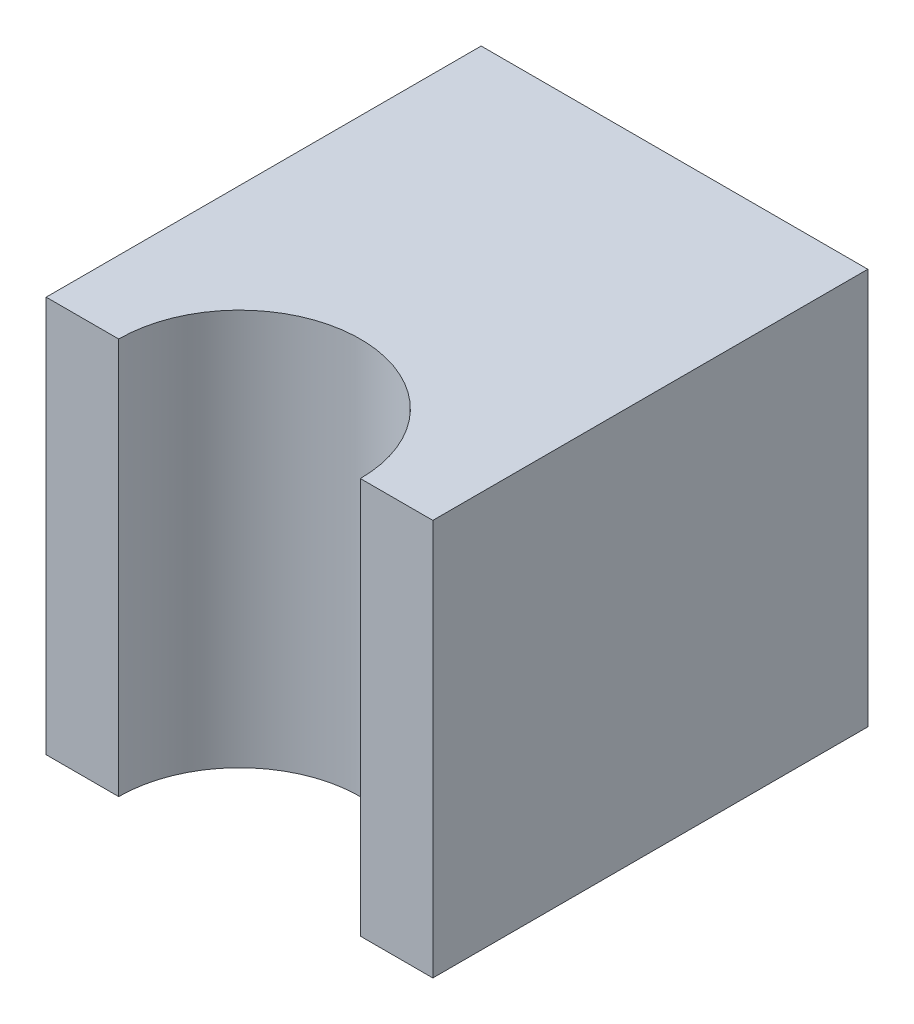
ISO-10303-21;
HEADER;
FILE_DESCRIPTION(('STEP AP214'),'2;1');
FILE_NAME('part.step','',(''),(''),'','','');
FILE_SCHEMA(('AUTOMOTIVE_DESIGN { 1 0 10303 214 1 1 1 1 }'));
ENDSEC;
DATA;
#1=APPLICATION_CONTEXT('core data for automotive mechanical design processes');
#2=APPLICATION_PROTOCOL_DEFINITION('international standard','automotive_design',2000,#1);
#3=PRODUCT_CONTEXT('',#1,'mechanical');
#4=PRODUCT('Part','Part','',(#3));
#5=PRODUCT_RELATED_PRODUCT_CATEGORY('part','',(#4));
#6=PRODUCT_DEFINITION_FORMATION('','',#4);
#7=PRODUCT_DEFINITION_CONTEXT('part definition',#1,'design');
#8=PRODUCT_DEFINITION('design','',#6,#7);
#9=PRODUCT_DEFINITION_SHAPE('','',#8);
#10=(LENGTH_UNIT() NAMED_UNIT(*) SI_UNIT(.MILLI.,.METRE.));
#11=(NAMED_UNIT(*) PLANE_ANGLE_UNIT() SI_UNIT($,.RADIAN.));
#12=(NAMED_UNIT(*) SI_UNIT($,.STERADIAN.) SOLID_ANGLE_UNIT());
#13=UNCERTAINTY_MEASURE_WITH_UNIT(LENGTH_MEASURE(1.E-05),#10,'distance_accuracy_value','');
#14=(GEOMETRIC_REPRESENTATION_CONTEXT(3) GLOBAL_UNCERTAINTY_ASSIGNED_CONTEXT((#13)) GLOBAL_UNIT_ASSIGNED_CONTEXT((#10,
#11,#12)) REPRESENTATION_CONTEXT('',''));
#15=CARTESIAN_POINT('',(0.,0.,0.));
#16=DIRECTION('',(0.,0.,1.));
#17=DIRECTION('',(1.,0.,0.));
#18=AXIS2_PLACEMENT_3D('',#15,#16,#17);
#19=CARTESIAN_POINT('',(5.05,0.,6.1));
#20=DIRECTION('',(0.,0.,1.));
#21=DIRECTION('',(1.,0.,0.));
#22=AXIS2_PLACEMENT_3D('',#19,#20,#21);
#23=PLANE('',#22);
#24=DIRECTION('',(1.,0.,0.));
#25=VECTOR('',#24,1.);
#26=CARTESIAN_POINT('',(4.8,0.82,6.1));
#27=LINE('',#26,#25);
#28=CARTESIAN_POINT('',(5.05,0.82,6.1));
#29=VERTEX_POINT('',#28);
#30=CARTESIAN_POINT('',(5.2,0.82,6.1));
#31=VERTEX_POINT('',#30);
#32=EDGE_CURVE('E76',#29,#31,#27,.T.);
#33=ORIENTED_EDGE('',*,*,#32,.F.);
#34=DIRECTION('',(0.,1.,0.));
#35=VECTOR('',#34,1.);
#36=CARTESIAN_POINT('',(5.05,0.,6.1));
#37=LINE('',#36,#35);
#38=CARTESIAN_POINT('',(5.05,0.,6.1));
#39=VERTEX_POINT('',#38);
#40=EDGE_CURVE('E72',#29,#39,#37,.F.);
#41=ORIENTED_EDGE('',*,*,#40,.T.);
#42=DIRECTION('',(1.,0.,0.));
#43=VECTOR('',#42,1.);
#44=CARTESIAN_POINT('',(4.8,0.,6.1));
#45=LINE('',#44,#43);
#46=CARTESIAN_POINT('',(5.2,0.,6.1));
#47=VERTEX_POINT('',#46);
#48=EDGE_CURVE('E73',#39,#47,#45,.T.);
#49=ORIENTED_EDGE('',*,*,#48,.T.);
#50=DIRECTION('',(0.,1.,0.));
#51=VECTOR('',#50,1.);
#52=CARTESIAN_POINT('',(5.2,0.,6.1));
#53=LINE('',#52,#51);
#54=EDGE_CURVE('E80',#31,#47,#53,.F.);
#55=ORIENTED_EDGE('',*,*,#54,.F.);
#56=EDGE_LOOP('',(#33,#41,#49,#55));
#57=FACE_BOUND('',#56,.T.);
#58=ADVANCED_FACE('F17',(#57),#23,.T.);
#59=CARTESIAN_POINT('',(4.8,0.,6.1));
#60=DIRECTION('',(0.,1.,0.));
#61=DIRECTION('',(0.,0.,1.));
#62=AXIS2_PLACEMENT_3D('',#59,#60,#61);
#63=CYLINDRICAL_SURFACE('',#62,0.25);
#64=ORIENTED_EDGE('',*,*,#40,.F.);
#65=CARTESIAN_POINT('',(4.8,0.82,6.1));
#66=DIRECTION('',(0.,1.,0.));
#67=DIRECTION('',(0.,0.,1.));
#68=AXIS2_PLACEMENT_3D('',#65,#66,#67);
#69=CIRCLE('',#68,0.25);
#70=CARTESIAN_POINT('',(4.55,0.82,6.1));
#71=VERTEX_POINT('',#70);
#72=EDGE_CURVE('E129',#71,#29,#69,.F.);
#73=ORIENTED_EDGE('',*,*,#72,.F.);
#74=DIRECTION('',(0.,1.,0.));
#75=VECTOR('',#74,1.);
#76=CARTESIAN_POINT('',(4.55,0.,6.1));
#77=LINE('',#76,#75);
#78=CARTESIAN_POINT('',(4.55,0.,6.1));
#79=VERTEX_POINT('',#78);
#80=EDGE_CURVE('E83',#79,#71,#77,.T.);
#81=ORIENTED_EDGE('',*,*,#80,.F.);
#82=CARTESIAN_POINT('',(4.8,0.,6.1));
#83=DIRECTION('',(0.,1.,0.));
#84=DIRECTION('',(0.,0.,1.));
#85=AXIS2_PLACEMENT_3D('',#82,#83,#84);
#86=CIRCLE('',#85,0.25);
#87=EDGE_CURVE('E20',#79,#39,#86,.F.);
#88=ORIENTED_EDGE('',*,*,#87,.T.);
#89=EDGE_LOOP('',(#64,#73,#81,#88));
#90=FACE_BOUND('',#89,.T.);
#91=ADVANCED_FACE('F82',(#90),#63,.F.);
#92=CARTESIAN_POINT('',(5.2,0.,6.1));
#93=DIRECTION('',(1.,0.,0.));
#94=DIRECTION('',(0.,0.,-1.));
#95=AXIS2_PLACEMENT_3D('',#92,#93,#94);
#96=PLANE('',#95);
#97=DIRECTION('',(0.,0.,1.));
#98=VECTOR('',#97,1.);
#99=CARTESIAN_POINT('',(5.2,0.82,5.65));
#100=LINE('',#99,#98);
#101=CARTESIAN_POINT('',(5.2,0.82,5.2));
#102=VERTEX_POINT('',#101);
#103=EDGE_CURVE('E108',#31,#102,#100,.F.);
#104=ORIENTED_EDGE('',*,*,#103,.F.);
#105=ORIENTED_EDGE('',*,*,#54,.T.);
#106=DIRECTION('',(0.,0.,1.));
#107=VECTOR('',#106,1.);
#108=CARTESIAN_POINT('',(5.2,0.,5.65));
#109=LINE('',#108,#107);
#110=CARTESIAN_POINT('',(5.2,0.,5.2));
#111=VERTEX_POINT('',#110);
#112=EDGE_CURVE('E85',#47,#111,#109,.F.);
#113=ORIENTED_EDGE('',*,*,#112,.T.);
#114=DIRECTION('',(0.,1.,0.));
#115=VECTOR('',#114,1.);
#116=CARTESIAN_POINT('',(5.2,0.,5.2));
#117=LINE('',#116,#115);
#118=EDGE_CURVE('E120',#102,#111,#117,.F.);
#119=ORIENTED_EDGE('',*,*,#118,.F.);
#120=EDGE_LOOP('',(#104,#105,#113,#119));
#121=FACE_BOUND('',#120,.T.);
#122=ADVANCED_FACE('F144',(#121),#96,.T.);
#123=CARTESIAN_POINT('',(4.8,0.,5.65));
#124=DIRECTION('',(0.,1.,0.));
#125=DIRECTION('',(0.,0.,1.));
#126=AXIS2_PLACEMENT_3D('',#123,#124,#125);
#127=PLANE('',#126);
#128=ORIENTED_EDGE('',*,*,#87,.F.);
#129=DIRECTION('',(1.,0.,0.));
#130=VECTOR('',#129,1.);
#131=CARTESIAN_POINT('',(4.4,0.,6.1));
#132=LINE('',#131,#130);
#133=CARTESIAN_POINT('',(4.4,0.,6.1));
#134=VERTEX_POINT('',#133);
#135=EDGE_CURVE('E88',#134,#79,#132,.T.);
#136=ORIENTED_EDGE('',*,*,#135,.F.);
#137=DIRECTION('',(0.,0.,1.));
#138=VECTOR('',#137,1.);
#139=CARTESIAN_POINT('',(4.4,0.,5.2));
#140=LINE('',#139,#138);
#141=CARTESIAN_POINT('',(4.4,0.,5.2));
#142=VERTEX_POINT('',#141);
#143=EDGE_CURVE('E105',#142,#134,#140,.T.);
#144=ORIENTED_EDGE('',*,*,#143,.F.);
#145=DIRECTION('',(-1.,0.,0.));
#146=VECTOR('',#145,1.);
#147=CARTESIAN_POINT('',(5.2,0.,5.2));
#148=LINE('',#147,#146);
#149=EDGE_CURVE('E126',#111,#142,#148,.T.);
#150=ORIENTED_EDGE('',*,*,#149,.F.);
#151=ORIENTED_EDGE('',*,*,#112,.F.);
#152=ORIENTED_EDGE('',*,*,#48,.F.);
#153=EDGE_LOOP('',(#128,#136,#144,#150,#151,#152));
#154=FACE_BOUND('',#153,.T.);
#155=ADVANCED_FACE('F86',(#154),#127,.F.);
#156=CARTESIAN_POINT('',(4.4,0.,6.1));
#157=DIRECTION('',(0.,0.,1.));
#158=DIRECTION('',(1.,0.,0.));
#159=AXIS2_PLACEMENT_3D('',#156,#157,#158);
#160=PLANE('',#159);
#161=DIRECTION('',(1.,0.,0.));
#162=VECTOR('',#161,1.);
#163=CARTESIAN_POINT('',(4.8,0.82,6.1));
#164=LINE('',#163,#162);
#165=CARTESIAN_POINT('',(4.4,0.82,6.1));
#166=VERTEX_POINT('',#165);
#167=EDGE_CURVE('E110',#166,#71,#164,.T.);
#168=ORIENTED_EDGE('',*,*,#167,.F.);
#169=DIRECTION('',(0.,1.,0.));
#170=VECTOR('',#169,1.);
#171=CARTESIAN_POINT('',(4.4,0.,6.1));
#172=LINE('',#171,#170);
#173=EDGE_CURVE('E100',#134,#166,#172,.T.);
#174=ORIENTED_EDGE('',*,*,#173,.F.);
#175=ORIENTED_EDGE('',*,*,#135,.T.);
#176=ORIENTED_EDGE('',*,*,#80,.T.);
#177=EDGE_LOOP('',(#168,#174,#175,#176));
#178=FACE_BOUND('',#177,.T.);
#179=ADVANCED_FACE('F151',(#178),#160,.T.);
#180=CARTESIAN_POINT('',(4.8,0.82,5.65));
#181=DIRECTION('',(0.,1.,0.));
#182=DIRECTION('',(0.,0.,1.));
#183=AXIS2_PLACEMENT_3D('',#180,#181,#182);
#184=PLANE('',#183);
#185=ORIENTED_EDGE('',*,*,#167,.T.);
#186=ORIENTED_EDGE('',*,*,#72,.T.);
#187=ORIENTED_EDGE('',*,*,#32,.T.);
#188=ORIENTED_EDGE('',*,*,#103,.T.);
#189=DIRECTION('',(-1.,0.,0.));
#190=VECTOR('',#189,1.);
#191=CARTESIAN_POINT('',(5.2,0.82,5.2));
#192=LINE('',#191,#190);
#193=CARTESIAN_POINT('',(4.4,0.82,5.2));
#194=VERTEX_POINT('',#193);
#195=EDGE_CURVE('E35',#194,#102,#192,.F.);
#196=ORIENTED_EDGE('',*,*,#195,.F.);
#197=DIRECTION('',(0.,0.,1.));
#198=VECTOR('',#197,1.);
#199=CARTESIAN_POINT('',(4.4,0.82,5.2));
#200=LINE('',#199,#198);
#201=EDGE_CURVE('E26',#166,#194,#200,.F.);
#202=ORIENTED_EDGE('',*,*,#201,.F.);
#203=EDGE_LOOP('',(#185,#186,#187,#188,#196,#202));
#204=FACE_BOUND('',#203,.T.);
#205=ADVANCED_FACE('F140',(#204),#184,.T.);
#206=CARTESIAN_POINT('',(5.2,0.,5.2));
#207=DIRECTION('',(0.,0.,-1.));
#208=DIRECTION('',(-1.,0.,0.));
#209=AXIS2_PLACEMENT_3D('',#206,#207,#208);
#210=PLANE('',#209);
#211=ORIENTED_EDGE('',*,*,#195,.T.);
#212=ORIENTED_EDGE('',*,*,#118,.T.);
#213=ORIENTED_EDGE('',*,*,#149,.T.);
#214=DIRECTION('',(0.,1.,0.));
#215=VECTOR('',#214,1.);
#216=CARTESIAN_POINT('',(4.4,0.,5.2));
#217=LINE('',#216,#215);
#218=EDGE_CURVE('E11',#194,#142,#217,.F.);
#219=ORIENTED_EDGE('',*,*,#218,.F.);
#220=EDGE_LOOP('',(#211,#212,#213,#219));
#221=FACE_BOUND('',#220,.T.);
#222=ADVANCED_FACE('F146',(#221),#210,.T.);
#223=CARTESIAN_POINT('',(4.4,0.,5.2));
#224=DIRECTION('',(-1.,0.,0.));
#225=DIRECTION('',(0.,0.,1.));
#226=AXIS2_PLACEMENT_3D('',#223,#224,#225);
#227=PLANE('',#226);
#228=ORIENTED_EDGE('',*,*,#201,.T.);
#229=ORIENTED_EDGE('',*,*,#218,.T.);
#230=ORIENTED_EDGE('',*,*,#143,.T.);
#231=ORIENTED_EDGE('',*,*,#173,.T.);
#232=EDGE_LOOP('',(#228,#229,#230,#231));
#233=FACE_BOUND('',#232,.T.);
#234=ADVANCED_FACE('F148',(#233),#227,.T.);
#235=CLOSED_SHELL('',(#58,#91,#122,#155,#179,#205,#222,#234));
#236=MANIFOLD_SOLID_BREP('B1',#235);
#237=ADVANCED_BREP_SHAPE_REPRESENTATION('',(#18,#236),#14);
#238=SHAPE_DEFINITION_REPRESENTATION(#9,#237);
ENDSEC;
END-ISO-10303-21;
